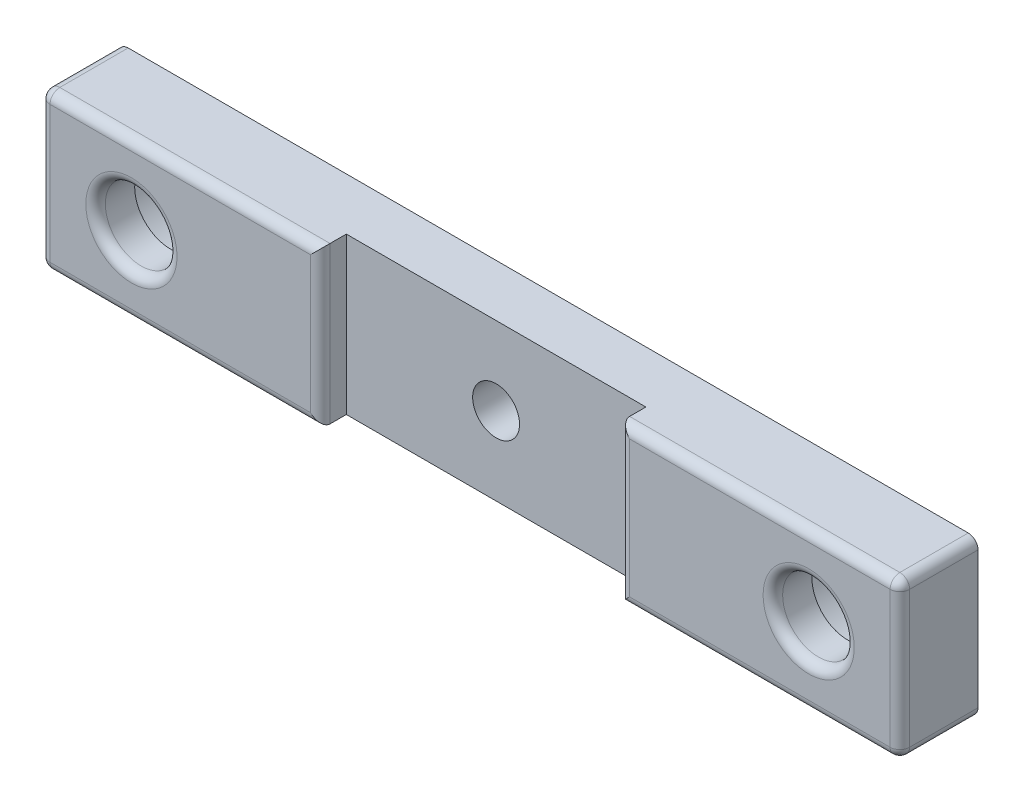
ISO-10303-21;
HEADER;
FILE_DESCRIPTION(('STEP AP214'),'2;1');
FILE_NAME('part.step','',(''),(''),'','','');
FILE_SCHEMA(('AUTOMOTIVE_DESIGN { 1 0 10303 214 1 1 1 1 }'));
ENDSEC;
DATA;
#1=APPLICATION_CONTEXT('core data for automotive mechanical design processes');
#2=APPLICATION_PROTOCOL_DEFINITION('international standard','automotive_design',2000,#1);
#3=PRODUCT_CONTEXT('',#1,'mechanical');
#4=PRODUCT('Part','Part','',(#3));
#5=PRODUCT_RELATED_PRODUCT_CATEGORY('part','',(#4));
#6=PRODUCT_DEFINITION_FORMATION('','',#4);
#7=PRODUCT_DEFINITION_CONTEXT('part definition',#1,'design');
#8=PRODUCT_DEFINITION('design','',#6,#7);
#9=PRODUCT_DEFINITION_SHAPE('','',#8);
#10=(LENGTH_UNIT() NAMED_UNIT(*) SI_UNIT(.MILLI.,.METRE.));
#11=(NAMED_UNIT(*) PLANE_ANGLE_UNIT() SI_UNIT($,.RADIAN.));
#12=(NAMED_UNIT(*) SI_UNIT($,.STERADIAN.) SOLID_ANGLE_UNIT());
#13=UNCERTAINTY_MEASURE_WITH_UNIT(LENGTH_MEASURE(1.E-05),#10,'distance_accuracy_value','');
#14=(GEOMETRIC_REPRESENTATION_CONTEXT(3) GLOBAL_UNCERTAINTY_ASSIGNED_CONTEXT((#13)) GLOBAL_UNIT_ASSIGNED_CONTEXT((#10,
#11,#12)) REPRESENTATION_CONTEXT('',''));
#15=CARTESIAN_POINT('',(0.,0.,0.));
#16=DIRECTION('',(0.,0.,1.));
#17=DIRECTION('',(1.,0.,0.));
#18=AXIS2_PLACEMENT_3D('',#15,#16,#17);
#19=CARTESIAN_POINT('',(7.,6.,6.));
#20=DIRECTION('',(0.,0.,-1.));
#21=DIRECTION('',(-1.,0.,0.));
#22=AXIS2_PLACEMENT_3D('',#19,#20,#21);
#23=CYLINDRICAL_SURFACE('',#22,2.75);
#24=CARTESIAN_POINT('',(7.,6.,5.25));
#25=DIRECTION('',(0.,0.,-1.));
#26=DIRECTION('',(-1.,0.,0.));
#27=AXIS2_PLACEMENT_3D('',#24,#25,#26);
#28=CIRCLE('',#27,2.75);
#29=CARTESIAN_POINT('',(4.25,6.,5.25));
#30=VERTEX_POINT('',#29);
#31=EDGE_CURVE('E264',#30,#30,#28,.F.);
#32=ORIENTED_EDGE('',*,*,#31,.T.);
#33=EDGE_LOOP('',(#32));
#34=FACE_BOUND('',#33,.T.);
#35=CARTESIAN_POINT('',(7.,6.,3.));
#36=DIRECTION('',(0.,0.,-1.));
#37=DIRECTION('',(-1.,0.,0.));
#38=AXIS2_PLACEMENT_3D('',#35,#36,#37);
#39=CIRCLE('',#38,2.75);
#40=CARTESIAN_POINT('',(4.25,6.,3.));
#41=VERTEX_POINT('',#40);
#42=EDGE_CURVE('E202',#41,#41,#39,.F.);
#43=ORIENTED_EDGE('',*,*,#42,.F.);
#44=EDGE_LOOP('',(#43));
#45=FACE_BOUND('',#44,.T.);
#46=ADVANCED_FACE('F32',(#34,#45),#23,.F.);
#47=CARTESIAN_POINT('',(59.,6.,6.));
#48=DIRECTION('',(0.,0.,-1.));
#49=DIRECTION('',(-1.,0.,0.));
#50=AXIS2_PLACEMENT_3D('',#47,#48,#49);
#51=CYLINDRICAL_SURFACE('',#50,2.75);
#52=CARTESIAN_POINT('',(59.,6.,5.25));
#53=DIRECTION('',(0.,0.,-1.));
#54=DIRECTION('',(-1.,0.,0.));
#55=AXIS2_PLACEMENT_3D('',#52,#53,#54);
#56=CIRCLE('',#55,2.75);
#57=CARTESIAN_POINT('',(56.25,6.,5.25));
#58=VERTEX_POINT('',#57);
#59=EDGE_CURVE('E243',#58,#58,#56,.F.);
#60=ORIENTED_EDGE('',*,*,#59,.T.);
#61=EDGE_LOOP('',(#60));
#62=FACE_BOUND('',#61,.T.);
#63=CARTESIAN_POINT('',(59.,6.,3.));
#64=DIRECTION('',(0.,0.,-1.));
#65=DIRECTION('',(-1.,0.,0.));
#66=AXIS2_PLACEMENT_3D('',#63,#64,#65);
#67=CIRCLE('',#66,2.75);
#68=CARTESIAN_POINT('',(56.25,6.,3.));
#69=VERTEX_POINT('',#68);
#70=EDGE_CURVE('E199',#69,#69,#67,.F.);
#71=ORIENTED_EDGE('',*,*,#70,.F.);
#72=EDGE_LOOP('',(#71));
#73=FACE_BOUND('',#72,.T.);
#74=ADVANCED_FACE('F395',(#62,#73),#51,.F.);
#75=CARTESIAN_POINT('',(0.,0.,6.));
#76=DIRECTION('',(0.,0.,-1.));
#77=DIRECTION('',(-1.,0.,0.));
#78=AXIS2_PLACEMENT_3D('',#75,#76,#77);
#79=PLANE('',#78);
#80=DIRECTION('',(-1.,0.,0.));
#81=VECTOR('',#80,1.);
#82=CARTESIAN_POINT('',(0.,11.25,6.));
#83=LINE('',#82,#81);
#84=CARTESIAN_POINT('',(20.75,11.25,6.));
#85=VERTEX_POINT('',#84);
#86=CARTESIAN_POINT('',(0.75,11.25,6.));
#87=VERTEX_POINT('',#86);
#88=EDGE_CURVE('E253',#85,#87,#83,.T.);
#89=ORIENTED_EDGE('',*,*,#88,.T.);
#90=DIRECTION('',(0.,-1.,0.));
#91=VECTOR('',#90,1.);
#92=CARTESIAN_POINT('',(0.75,0.,6.));
#93=LINE('',#92,#91);
#94=CARTESIAN_POINT('',(0.75,0.75,6.));
#95=VERTEX_POINT('',#94);
#96=EDGE_CURVE('E255',#87,#95,#93,.T.);
#97=ORIENTED_EDGE('',*,*,#96,.T.);
#98=DIRECTION('',(1.,0.,0.));
#99=VECTOR('',#98,1.);
#100=CARTESIAN_POINT('',(0.,0.75,6.));
#101=LINE('',#100,#99);
#102=CARTESIAN_POINT('',(20.75,0.75,6.));
#103=VERTEX_POINT('',#102);
#104=EDGE_CURVE('E249',#95,#103,#101,.T.);
#105=ORIENTED_EDGE('',*,*,#104,.T.);
#106=DIRECTION('',(0.,-1.,0.));
#107=VECTOR('',#106,1.);
#108=CARTESIAN_POINT('',(20.75,0.,6.));
#109=LINE('',#108,#107);
#110=EDGE_CURVE('E251',#103,#85,#109,.F.);
#111=ORIENTED_EDGE('',*,*,#110,.T.);
#112=EDGE_LOOP('',(#89,#97,#105,#111));
#113=FACE_BOUND('',#112,.T.);
#114=CARTESIAN_POINT('',(7.,6.,6.));
#115=DIRECTION('',(0.,0.,-1.));
#116=DIRECTION('',(-1.,0.,0.));
#117=AXIS2_PLACEMENT_3D('',#114,#115,#116);
#118=CIRCLE('',#117,3.5);
#119=CARTESIAN_POINT('',(3.5,6.,6.));
#120=VERTEX_POINT('',#119);
#121=EDGE_CURVE('E246',#120,#120,#118,.T.);
#122=ORIENTED_EDGE('',*,*,#121,.T.);
#123=EDGE_LOOP('',(#122));
#124=FACE_BOUND('',#123,.T.);
#125=ADVANCED_FACE('F401',(#113,#124),#79,.F.);
#126=CARTESIAN_POINT('',(0.,0.,6.));
#127=DIRECTION('',(1.,0.,0.));
#128=DIRECTION('',(0.,0.,-1.));
#129=AXIS2_PLACEMENT_3D('',#126,#127,#128);
#130=PLANE('',#129);
#131=DIRECTION('',(0.,-1.,0.));
#132=VECTOR('',#131,1.);
#133=CARTESIAN_POINT('',(0.,0.,5.25));
#134=LINE('',#133,#132);
#135=CARTESIAN_POINT('',(0.,0.75,5.25));
#136=VERTEX_POINT('',#135);
#137=CARTESIAN_POINT('',(0.,11.25,5.25));
#138=VERTEX_POINT('',#137);
#139=EDGE_CURVE('E259',#136,#138,#134,.F.);
#140=ORIENTED_EDGE('',*,*,#139,.T.);
#141=DIRECTION('',(0.,0.,-1.));
#142=VECTOR('',#141,1.);
#143=CARTESIAN_POINT('',(0.,11.25,6.));
#144=LINE('',#143,#142);
#145=CARTESIAN_POINT('',(0.,11.25,0.));
#146=VERTEX_POINT('',#145);
#147=EDGE_CURVE('E261',#138,#146,#144,.T.);
#148=ORIENTED_EDGE('',*,*,#147,.T.);
#149=DIRECTION('',(0.,-1.,0.));
#150=VECTOR('',#149,1.);
#151=CARTESIAN_POINT('',(0.,0.,0.));
#152=LINE('',#151,#150);
#153=CARTESIAN_POINT('',(0.,0.75,0.));
#154=VERTEX_POINT('',#153);
#155=EDGE_CURVE('E183',#146,#154,#152,.T.);
#156=ORIENTED_EDGE('',*,*,#155,.T.);
#157=DIRECTION('',(0.,0.,-1.));
#158=VECTOR('',#157,1.);
#159=CARTESIAN_POINT('',(0.,0.75,6.));
#160=LINE('',#159,#158);
#161=EDGE_CURVE('E57',#154,#136,#160,.F.);
#162=ORIENTED_EDGE('',*,*,#161,.T.);
#163=EDGE_LOOP('',(#140,#148,#156,#162));
#164=FACE_BOUND('',#163,.T.);
#165=ADVANCED_FACE('F335',(#164),#130,.F.);
#166=CARTESIAN_POINT('',(0.,0.,6.));
#167=DIRECTION('',(0.,1.,0.));
#168=DIRECTION('',(0.,0.,1.));
#169=AXIS2_PLACEMENT_3D('',#166,#167,#168);
#170=PLANE('',#169);
#171=DIRECTION('',(0.,0.,1.));
#172=VECTOR('',#171,1.);
#173=CARTESIAN_POINT('',(21.5,0.,4.));
#174=LINE('',#173,#172);
#175=CARTESIAN_POINT('',(21.5,0.,4.));
#176=VERTEX_POINT('',#175);
#177=CARTESIAN_POINT('',(21.5,0.,5.25));
#178=VERTEX_POINT('',#177);
#179=EDGE_CURVE('E149',#176,#178,#174,.T.);
#180=ORIENTED_EDGE('',*,*,#179,.T.);
#181=DIRECTION('',(1.,0.,0.));
#182=VECTOR('',#181,1.);
#183=CARTESIAN_POINT('',(0.,0.,5.25));
#184=LINE('',#183,#182);
#185=CARTESIAN_POINT('',(0.75,0.,5.25));
#186=VERTEX_POINT('',#185);
#187=EDGE_CURVE('E231',#178,#186,#184,.F.);
#188=ORIENTED_EDGE('',*,*,#187,.T.);
#189=DIRECTION('',(0.,0.,-1.));
#190=VECTOR('',#189,1.);
#191=CARTESIAN_POINT('',(0.75,0.,6.));
#192=LINE('',#191,#190);
#193=CARTESIAN_POINT('',(0.75,0.,0.));
#194=VERTEX_POINT('',#193);
#195=EDGE_CURVE('E229',#186,#194,#192,.T.);
#196=ORIENTED_EDGE('',*,*,#195,.T.);
#197=DIRECTION('',(1.,0.,0.));
#198=VECTOR('',#197,1.);
#199=CARTESIAN_POINT('',(0.,0.,0.));
#200=LINE('',#199,#198);
#201=CARTESIAN_POINT('',(65.25,0.,0.));
#202=VERTEX_POINT('',#201);
#203=EDGE_CURVE('E189',#194,#202,#200,.T.);
#204=ORIENTED_EDGE('',*,*,#203,.T.);
#205=DIRECTION('',(0.,0.,-1.));
#206=VECTOR('',#205,1.);
#207=CARTESIAN_POINT('',(65.25,0.,6.));
#208=LINE('',#207,#206);
#209=CARTESIAN_POINT('',(65.25,0.,5.25));
#210=VERTEX_POINT('',#209);
#211=EDGE_CURVE('E225',#202,#210,#208,.F.);
#212=ORIENTED_EDGE('',*,*,#211,.T.);
#213=DIRECTION('',(1.,0.,0.));
#214=VECTOR('',#213,1.);
#215=CARTESIAN_POINT('',(0.,0.,5.25));
#216=LINE('',#215,#214);
#217=CARTESIAN_POINT('',(44.5,0.,5.25));
#218=VERTEX_POINT('',#217);
#219=EDGE_CURVE('E227',#210,#218,#216,.F.);
#220=ORIENTED_EDGE('',*,*,#219,.T.);
#221=DIRECTION('',(0.,0.,1.));
#222=VECTOR('',#221,1.);
#223=CARTESIAN_POINT('',(44.5,0.,4.));
#224=LINE('',#223,#222);
#225=CARTESIAN_POINT('',(44.5,0.,4.));
#226=VERTEX_POINT('',#225);
#227=EDGE_CURVE('E160',#226,#218,#224,.T.);
#228=ORIENTED_EDGE('',*,*,#227,.F.);
#229=DIRECTION('',(1.,0.,0.));
#230=VECTOR('',#229,1.);
#231=CARTESIAN_POINT('',(21.5,0.,4.));
#232=LINE('',#231,#230);
#233=EDGE_CURVE('E167',#176,#226,#232,.T.);
#234=ORIENTED_EDGE('',*,*,#233,.F.);
#235=EDGE_LOOP('',(#180,#188,#196,#204,#212,#220,#228,#234));
#236=FACE_BOUND('',#235,.T.);
#237=ADVANCED_FACE('F173',(#236),#170,.F.);
#238=CARTESIAN_POINT('',(66.,0.,6.));
#239=DIRECTION('',(-1.,0.,0.));
#240=DIRECTION('',(0.,0.,1.));
#241=AXIS2_PLACEMENT_3D('',#238,#239,#240);
#242=PLANE('',#241);
#243=DIRECTION('',(0.,1.,0.));
#244=VECTOR('',#243,1.);
#245=CARTESIAN_POINT('',(66.,0.,5.25));
#246=LINE('',#245,#244);
#247=CARTESIAN_POINT('',(66.,11.25,5.25));
#248=VERTEX_POINT('',#247);
#249=CARTESIAN_POINT('',(66.,0.75,5.25));
#250=VERTEX_POINT('',#249);
#251=EDGE_CURVE('E220',#248,#250,#246,.F.);
#252=ORIENTED_EDGE('',*,*,#251,.T.);
#253=DIRECTION('',(0.,0.,-1.));
#254=VECTOR('',#253,1.);
#255=CARTESIAN_POINT('',(66.,0.75,6.));
#256=LINE('',#255,#254);
#257=CARTESIAN_POINT('',(66.,0.75,0.));
#258=VERTEX_POINT('',#257);
#259=EDGE_CURVE('E223',#250,#258,#256,.T.);
#260=ORIENTED_EDGE('',*,*,#259,.T.);
#261=DIRECTION('',(0.,1.,0.));
#262=VECTOR('',#261,1.);
#263=CARTESIAN_POINT('',(66.,0.,0.));
#264=LINE('',#263,#262);
#265=CARTESIAN_POINT('',(66.,11.25,0.));
#266=VERTEX_POINT('',#265);
#267=EDGE_CURVE('E192',#258,#266,#264,.T.);
#268=ORIENTED_EDGE('',*,*,#267,.T.);
#269=DIRECTION('',(0.,0.,-1.));
#270=VECTOR('',#269,1.);
#271=CARTESIAN_POINT('',(66.,11.25,6.));
#272=LINE('',#271,#270);
#273=EDGE_CURVE('E218',#266,#248,#272,.F.);
#274=ORIENTED_EDGE('',*,*,#273,.T.);
#275=EDGE_LOOP('',(#252,#260,#268,#274));
#276=FACE_BOUND('',#275,.T.);
#277=ADVANCED_FACE('F363',(#276),#242,.F.);
#278=CARTESIAN_POINT('',(0.,12.,6.));
#279=DIRECTION('',(0.,-1.,0.));
#280=DIRECTION('',(0.,0.,-1.));
#281=AXIS2_PLACEMENT_3D('',#278,#279,#280);
#282=PLANE('',#281);
#283=DIRECTION('',(0.,0.,-1.));
#284=VECTOR('',#283,1.);
#285=CARTESIAN_POINT('',(0.75,12.,6.));
#286=LINE('',#285,#284);
#287=CARTESIAN_POINT('',(0.75,12.,0.));
#288=VERTEX_POINT('',#287);
#289=CARTESIAN_POINT('',(0.75,12.,5.25));
#290=VERTEX_POINT('',#289);
#291=EDGE_CURVE('E239',#288,#290,#286,.F.);
#292=ORIENTED_EDGE('',*,*,#291,.T.);
#293=DIRECTION('',(-1.,0.,0.));
#294=VECTOR('',#293,1.);
#295=CARTESIAN_POINT('',(0.,12.,5.25));
#296=LINE('',#295,#294);
#297=CARTESIAN_POINT('',(21.5,12.,5.25));
#298=VERTEX_POINT('',#297);
#299=EDGE_CURVE('E241',#290,#298,#296,.F.);
#300=ORIENTED_EDGE('',*,*,#299,.T.);
#301=DIRECTION('',(0.,0.,1.));
#302=VECTOR('',#301,1.);
#303=CARTESIAN_POINT('',(21.5,12.,4.));
#304=LINE('',#303,#302);
#305=CARTESIAN_POINT('',(21.5,12.,4.));
#306=VERTEX_POINT('',#305);
#307=EDGE_CURVE('E181',#306,#298,#304,.T.);
#308=ORIENTED_EDGE('',*,*,#307,.F.);
#309=DIRECTION('',(-1.,0.,0.));
#310=VECTOR('',#309,1.);
#311=CARTESIAN_POINT('',(21.5,12.,4.));
#312=LINE('',#311,#310);
#313=CARTESIAN_POINT('',(44.5,12.,4.));
#314=VERTEX_POINT('',#313);
#315=EDGE_CURVE('E161',#314,#306,#312,.T.);
#316=ORIENTED_EDGE('',*,*,#315,.F.);
#317=DIRECTION('',(0.,0.,1.));
#318=VECTOR('',#317,1.);
#319=CARTESIAN_POINT('',(44.5,12.,4.));
#320=LINE('',#319,#318);
#321=CARTESIAN_POINT('',(44.5,12.,5.25));
#322=VERTEX_POINT('',#321);
#323=EDGE_CURVE('E184',#314,#322,#320,.T.);
#324=ORIENTED_EDGE('',*,*,#323,.T.);
#325=DIRECTION('',(-1.,0.,0.));
#326=VECTOR('',#325,1.);
#327=CARTESIAN_POINT('',(0.,12.,5.25));
#328=LINE('',#327,#326);
#329=CARTESIAN_POINT('',(65.25,12.,5.25));
#330=VERTEX_POINT('',#329);
#331=EDGE_CURVE('E237',#322,#330,#328,.F.);
#332=ORIENTED_EDGE('',*,*,#331,.T.);
#333=DIRECTION('',(0.,0.,-1.));
#334=VECTOR('',#333,1.);
#335=CARTESIAN_POINT('',(65.25,12.,6.));
#336=LINE('',#335,#334);
#337=CARTESIAN_POINT('',(65.25,12.,0.));
#338=VERTEX_POINT('',#337);
#339=EDGE_CURVE('E235',#330,#338,#336,.T.);
#340=ORIENTED_EDGE('',*,*,#339,.T.);
#341=DIRECTION('',(-1.,0.,0.));
#342=VECTOR('',#341,1.);
#343=CARTESIAN_POINT('',(0.,12.,0.));
#344=LINE('',#343,#342);
#345=EDGE_CURVE('E195',#338,#288,#344,.T.);
#346=ORIENTED_EDGE('',*,*,#345,.T.);
#347=EDGE_LOOP('',(#292,#300,#308,#316,#324,#332,#340,#346));
#348=FACE_BOUND('',#347,.T.);
#349=ADVANCED_FACE('F343',(#348),#282,.F.);
#350=DIRECTION('',(1.,0.,0.));
#351=VECTOR('',#350,1.);
#352=CARTESIAN_POINT('',(0.,0.75,6.));
#353=LINE('',#352,#351);
#354=CARTESIAN_POINT('',(45.25,0.75,6.));
#355=VERTEX_POINT('',#354);
#356=CARTESIAN_POINT('',(65.25,0.75,6.));
#357=VERTEX_POINT('',#356);
#358=EDGE_CURVE('E213',#355,#357,#353,.T.);
#359=ORIENTED_EDGE('',*,*,#358,.T.);
#360=DIRECTION('',(0.,1.,0.));
#361=VECTOR('',#360,1.);
#362=CARTESIAN_POINT('',(65.25,0.,6.));
#363=LINE('',#362,#361);
#364=CARTESIAN_POINT('',(65.25,11.25,6.));
#365=VERTEX_POINT('',#364);
#366=EDGE_CURVE('E215',#357,#365,#363,.T.);
#367=ORIENTED_EDGE('',*,*,#366,.T.);
#368=DIRECTION('',(-1.,0.,0.));
#369=VECTOR('',#368,1.);
#370=CARTESIAN_POINT('',(0.,11.25,6.));
#371=LINE('',#370,#369);
#372=CARTESIAN_POINT('',(45.25,11.25,6.));
#373=VERTEX_POINT('',#372);
#374=EDGE_CURVE('E209',#365,#373,#371,.T.);
#375=ORIENTED_EDGE('',*,*,#374,.T.);
#376=DIRECTION('',(0.,1.,0.));
#377=VECTOR('',#376,1.);
#378=CARTESIAN_POINT('',(45.25,0.,6.));
#379=LINE('',#378,#377);
#380=EDGE_CURVE('E211',#373,#355,#379,.F.);
#381=ORIENTED_EDGE('',*,*,#380,.T.);
#382=EDGE_LOOP('',(#359,#367,#375,#381));
#383=FACE_BOUND('',#382,.T.);
#384=CARTESIAN_POINT('',(59.,6.,6.));
#385=DIRECTION('',(0.,0.,-1.));
#386=DIRECTION('',(-1.,0.,0.));
#387=AXIS2_PLACEMENT_3D('',#384,#385,#386);
#388=CIRCLE('',#387,3.5);
#389=CARTESIAN_POINT('',(55.5,6.,6.));
#390=VERTEX_POINT('',#389);
#391=EDGE_CURVE('E198',#390,#390,#388,.T.);
#392=ORIENTED_EDGE('',*,*,#391,.T.);
#393=EDGE_LOOP('',(#392));
#394=FACE_BOUND('',#393,.T.);
#395=ADVANCED_FACE('F443',(#383,#394),#79,.F.);
#396=CARTESIAN_POINT('',(0.,0.,0.));
#397=DIRECTION('',(0.,0.,-1.));
#398=DIRECTION('',(-1.,0.,0.));
#399=AXIS2_PLACEMENT_3D('',#396,#397,#398);
#400=PLANE('',#399);
#401=CARTESIAN_POINT('',(59.,6.,0.));
#402=DIRECTION('',(0.,0.,-1.));
#403=DIRECTION('',(-1.,0.,0.));
#404=AXIS2_PLACEMENT_3D('',#401,#402,#403);
#405=CIRCLE('',#404,5.1);
#406=CARTESIAN_POINT('',(53.9,6.,0.));
#407=VERTEX_POINT('',#406);
#408=EDGE_CURVE('E428',#407,#407,#405,.T.);
#409=ORIENTED_EDGE('',*,*,#408,.F.);
#410=EDGE_LOOP('',(#409));
#411=FACE_BOUND('',#410,.T.);
#412=CARTESIAN_POINT('',(7.,6.,0.));
#413=DIRECTION('',(0.,0.,-1.));
#414=DIRECTION('',(-1.,0.,0.));
#415=AXIS2_PLACEMENT_3D('',#412,#413,#414);
#416=CIRCLE('',#415,5.1);
#417=CARTESIAN_POINT('',(1.9,6.,0.));
#418=VERTEX_POINT('',#417);
#419=EDGE_CURVE('E294',#418,#418,#416,.T.);
#420=ORIENTED_EDGE('',*,*,#419,.F.);
#421=EDGE_LOOP('',(#420));
#422=FACE_BOUND('',#421,.T.);
#423=CARTESIAN_POINT('',(33.,6.,0.));
#424=DIRECTION('',(0.,0.,1.));
#425=DIRECTION('',(1.,0.,0.));
#426=AXIS2_PLACEMENT_3D('',#423,#424,#425);
#427=CIRCLE('',#426,1.8);
#428=CARTESIAN_POINT('',(34.8,6.,0.));
#429=VERTEX_POINT('',#428);
#430=EDGE_CURVE('E171',#429,#429,#427,.T.);
#431=ORIENTED_EDGE('',*,*,#430,.T.);
#432=EDGE_LOOP('',(#431));
#433=FACE_BOUND('',#432,.T.);
#434=ORIENTED_EDGE('',*,*,#155,.F.);
#435=CARTESIAN_POINT('',(0.75,11.25,0.));
#436=DIRECTION('',(0.,0.,-1.));
#437=DIRECTION('',(-1.,0.,0.));
#438=AXIS2_PLACEMENT_3D('',#435,#436,#437);
#439=CIRCLE('',#438,0.75);
#440=EDGE_CURVE('E11',#146,#288,#439,.T.);
#441=ORIENTED_EDGE('',*,*,#440,.T.);
#442=ORIENTED_EDGE('',*,*,#345,.F.);
#443=CARTESIAN_POINT('',(65.25,11.25,0.));
#444=DIRECTION('',(0.,0.,-1.));
#445=DIRECTION('',(-1.,0.,0.));
#446=AXIS2_PLACEMENT_3D('',#443,#444,#445);
#447=CIRCLE('',#446,0.75);
#448=EDGE_CURVE('E267',#338,#266,#447,.T.);
#449=ORIENTED_EDGE('',*,*,#448,.T.);
#450=ORIENTED_EDGE('',*,*,#267,.F.);
#451=CARTESIAN_POINT('',(65.25,0.75,0.));
#452=DIRECTION('',(0.,0.,-1.));
#453=DIRECTION('',(-1.,0.,0.));
#454=AXIS2_PLACEMENT_3D('',#451,#452,#453);
#455=CIRCLE('',#454,0.75);
#456=EDGE_CURVE('E269',#258,#202,#455,.T.);
#457=ORIENTED_EDGE('',*,*,#456,.T.);
#458=ORIENTED_EDGE('',*,*,#203,.F.);
#459=CARTESIAN_POINT('',(0.75,0.75,0.));
#460=DIRECTION('',(0.,0.,-1.));
#461=DIRECTION('',(-1.,0.,0.));
#462=AXIS2_PLACEMENT_3D('',#459,#460,#461);
#463=CIRCLE('',#462,0.75);
#464=EDGE_CURVE('E41',#194,#154,#463,.T.);
#465=ORIENTED_EDGE('',*,*,#464,.T.);
#466=EDGE_LOOP('',(#434,#441,#442,#449,#450,#457,#458,#465));
#467=FACE_BOUND('',#466,.T.);
#468=ADVANCED_FACE('F333',(#411,#422,#433,#467),#400,.T.);
#469=CARTESIAN_POINT('',(21.5,0.,4.));
#470=DIRECTION('',(-1.,0.,0.));
#471=DIRECTION('',(0.,0.,1.));
#472=AXIS2_PLACEMENT_3D('',#469,#470,#471);
#473=PLANE('',#472);
#474=ORIENTED_EDGE('',*,*,#307,.T.);
#475=DIRECTION('',(0.,-1.,0.));
#476=VECTOR('',#475,1.);
#477=CARTESIAN_POINT('',(21.5,0.,5.25));
#478=LINE('',#477,#476);
#479=EDGE_CURVE('E156',#298,#178,#478,.T.);
#480=ORIENTED_EDGE('',*,*,#479,.T.);
#481=ORIENTED_EDGE('',*,*,#179,.F.);
#482=DIRECTION('',(0.,-1.,0.));
#483=VECTOR('',#482,1.);
#484=CARTESIAN_POINT('',(21.5,0.,4.));
#485=LINE('',#484,#483);
#486=EDGE_CURVE('E153',#306,#176,#485,.T.);
#487=ORIENTED_EDGE('',*,*,#486,.F.);
#488=EDGE_LOOP('',(#474,#480,#481,#487));
#489=FACE_BOUND('',#488,.T.);
#490=ADVANCED_FACE('F152',(#489),#473,.F.);
#491=CARTESIAN_POINT('',(44.5,0.,4.));
#492=DIRECTION('',(1.,0.,0.));
#493=DIRECTION('',(0.,0.,-1.));
#494=AXIS2_PLACEMENT_3D('',#491,#492,#493);
#495=PLANE('',#494);
#496=ORIENTED_EDGE('',*,*,#227,.T.);
#497=DIRECTION('',(0.,1.,0.));
#498=VECTOR('',#497,1.);
#499=CARTESIAN_POINT('',(44.5,0.,5.25));
#500=LINE('',#499,#498);
#501=EDGE_CURVE('E233',#218,#322,#500,.T.);
#502=ORIENTED_EDGE('',*,*,#501,.T.);
#503=ORIENTED_EDGE('',*,*,#323,.F.);
#504=DIRECTION('',(0.,1.,0.));
#505=VECTOR('',#504,1.);
#506=CARTESIAN_POINT('',(44.5,0.,4.));
#507=LINE('',#506,#505);
#508=EDGE_CURVE('E175',#226,#314,#507,.T.);
#509=ORIENTED_EDGE('',*,*,#508,.F.);
#510=EDGE_LOOP('',(#496,#502,#503,#509));
#511=FACE_BOUND('',#510,.T.);
#512=ADVANCED_FACE('F383',(#511),#495,.F.);
#513=CARTESIAN_POINT('',(0.,0.,4.));
#514=DIRECTION('',(0.,0.,-1.));
#515=DIRECTION('',(-1.,0.,0.));
#516=AXIS2_PLACEMENT_3D('',#513,#514,#515);
#517=PLANE('',#516);
#518=CARTESIAN_POINT('',(33.,6.,4.));
#519=DIRECTION('',(0.,0.,1.));
#520=DIRECTION('',(1.,0.,0.));
#521=AXIS2_PLACEMENT_3D('',#518,#519,#520);
#522=CIRCLE('',#521,1.8);
#523=CARTESIAN_POINT('',(34.8,6.,4.));
#524=VERTEX_POINT('',#523);
#525=EDGE_CURVE('E206',#524,#524,#522,.T.);
#526=ORIENTED_EDGE('',*,*,#525,.F.);
#527=EDGE_LOOP('',(#526));
#528=FACE_BOUND('',#527,.T.);
#529=ORIENTED_EDGE('',*,*,#486,.T.);
#530=ORIENTED_EDGE('',*,*,#233,.T.);
#531=ORIENTED_EDGE('',*,*,#508,.T.);
#532=ORIENTED_EDGE('',*,*,#315,.T.);
#533=EDGE_LOOP('',(#529,#530,#531,#532));
#534=FACE_BOUND('',#533,.T.);
#535=ADVANCED_FACE('F165',(#528,#534),#517,.F.);
#536=CARTESIAN_POINT('',(33.,6.,0.));
#537=DIRECTION('',(0.,0.,1.));
#538=DIRECTION('',(1.,0.,0.));
#539=AXIS2_PLACEMENT_3D('',#536,#537,#538);
#540=CYLINDRICAL_SURFACE('',#539,1.8);
#541=ORIENTED_EDGE('',*,*,#430,.F.);
#542=EDGE_LOOP('',(#541));
#543=FACE_BOUND('',#542,.T.);
#544=ORIENTED_EDGE('',*,*,#525,.T.);
#545=EDGE_LOOP('',(#544));
#546=FACE_BOUND('',#545,.T.);
#547=ADVANCED_FACE('F390',(#543,#546),#540,.F.);
#548=CARTESIAN_POINT('',(59.,6.,3.));
#549=DIRECTION('',(0.,0.,-1.));
#550=DIRECTION('',(-1.,0.,0.));
#551=AXIS2_PLACEMENT_3D('',#548,#549,#550);
#552=PLANE('',#551);
#553=CARTESIAN_POINT('',(59.,6.,3.));
#554=DIRECTION('',(0.,0.,-1.));
#555=DIRECTION('',(-1.,0.,0.));
#556=AXIS2_PLACEMENT_3D('',#553,#554,#555);
#557=CIRCLE('',#556,5.1);
#558=CARTESIAN_POINT('',(53.9,6.,3.));
#559=VERTEX_POINT('',#558);
#560=EDGE_CURVE('E203',#559,#559,#557,.T.);
#561=ORIENTED_EDGE('',*,*,#560,.T.);
#562=EDGE_LOOP('',(#561));
#563=FACE_BOUND('',#562,.T.);
#564=ORIENTED_EDGE('',*,*,#70,.T.);
#565=EDGE_LOOP('',(#564));
#566=FACE_BOUND('',#565,.T.);
#567=ADVANCED_FACE('F408',(#563,#566),#552,.T.);
#568=CARTESIAN_POINT('',(59.,6.,3.));
#569=DIRECTION('',(0.,0.,-1.));
#570=DIRECTION('',(-1.,0.,0.));
#571=AXIS2_PLACEMENT_3D('',#568,#569,#570);
#572=CYLINDRICAL_SURFACE('',#571,5.1);
#573=ORIENTED_EDGE('',*,*,#560,.F.);
#574=EDGE_LOOP('',(#573));
#575=FACE_BOUND('',#574,.T.);
#576=ORIENTED_EDGE('',*,*,#408,.T.);
#577=EDGE_LOOP('',(#576));
#578=FACE_BOUND('',#577,.T.);
#579=ADVANCED_FACE('F413',(#575,#578),#572,.F.);
#580=CARTESIAN_POINT('',(7.,6.,3.));
#581=DIRECTION('',(0.,0.,-1.));
#582=DIRECTION('',(-1.,0.,0.));
#583=AXIS2_PLACEMENT_3D('',#580,#581,#582);
#584=PLANE('',#583);
#585=CARTESIAN_POINT('',(7.,6.,3.));
#586=DIRECTION('',(0.,0.,-1.));
#587=DIRECTION('',(-1.,0.,0.));
#588=AXIS2_PLACEMENT_3D('',#585,#586,#587);
#589=CIRCLE('',#588,5.1);
#590=CARTESIAN_POINT('',(1.9,6.,3.));
#591=VERTEX_POINT('',#590);
#592=EDGE_CURVE('E425',#591,#591,#589,.T.);
#593=ORIENTED_EDGE('',*,*,#592,.T.);
#594=EDGE_LOOP('',(#593));
#595=FACE_BOUND('',#594,.T.);
#596=ORIENTED_EDGE('',*,*,#42,.T.);
#597=EDGE_LOOP('',(#596));
#598=FACE_BOUND('',#597,.T.);
#599=ADVANCED_FACE('F437',(#595,#598),#584,.T.);
#600=CARTESIAN_POINT('',(7.,6.,3.));
#601=DIRECTION('',(0.,0.,-1.));
#602=DIRECTION('',(-1.,0.,0.));
#603=AXIS2_PLACEMENT_3D('',#600,#601,#602);
#604=CYLINDRICAL_SURFACE('',#603,5.1);
#605=ORIENTED_EDGE('',*,*,#592,.F.);
#606=EDGE_LOOP('',(#605));
#607=FACE_BOUND('',#606,.T.);
#608=ORIENTED_EDGE('',*,*,#419,.T.);
#609=EDGE_LOOP('',(#608));
#610=FACE_BOUND('',#609,.T.);
#611=ADVANCED_FACE('F448',(#607,#610),#604,.F.);
#612=CARTESIAN_POINT('',(45.25,0.,5.25));
#613=DIRECTION('',(0.,1.,0.));
#614=DIRECTION('',(0.,0.,1.));
#615=AXIS2_PLACEMENT_3D('',#612,#613,#614);
#616=CYLINDRICAL_SURFACE('',#615,0.75);
#617=CARTESIAN_POINT('',(45.25,11.25,5.25));
#618=DIRECTION('',(-0.707106781186547,-0.707106781186547,0.));
#619=DIRECTION('',(-0.707106781186547,0.707106781186547,0.));
#620=AXIS2_PLACEMENT_3D('',#617,#618,#619);
#621=ELLIPSE('',#620,1.06066017177982,0.75);
#622=EDGE_CURVE('E288',#322,#373,#621,.F.);
#623=ORIENTED_EDGE('',*,*,#622,.F.);
#624=ORIENTED_EDGE('',*,*,#501,.F.);
#625=CARTESIAN_POINT('',(45.25,0.75,5.25));
#626=DIRECTION('',(-0.707106781186547,0.707106781186547,0.));
#627=DIRECTION('',(0.707106781186547,0.707106781186547,0.));
#628=AXIS2_PLACEMENT_3D('',#625,#626,#627);
#629=ELLIPSE('',#628,1.06066017177982,0.75);
#630=EDGE_CURVE('E291',#355,#218,#629,.F.);
#631=ORIENTED_EDGE('',*,*,#630,.F.);
#632=ORIENTED_EDGE('',*,*,#380,.F.);
#633=EDGE_LOOP('',(#623,#624,#631,#632));
#634=FACE_BOUND('',#633,.T.);
#635=ADVANCED_FACE('F381',(#634),#616,.T.);
#636=CARTESIAN_POINT('',(65.25,0.75,6.));
#637=DIRECTION('',(0.,0.,-1.));
#638=DIRECTION('',(-1.,0.,0.));
#639=AXIS2_PLACEMENT_3D('',#636,#637,#638);
#640=CYLINDRICAL_SURFACE('',#639,0.75);
#641=ORIENTED_EDGE('',*,*,#456,.F.);
#642=ORIENTED_EDGE('',*,*,#259,.F.);
#643=CARTESIAN_POINT('',(65.25,0.75,5.25));
#644=DIRECTION('',(0.,0.,1.));
#645=DIRECTION('',(1.,0.,0.));
#646=AXIS2_PLACEMENT_3D('',#643,#644,#645);
#647=CIRCLE('',#646,0.75);
#648=EDGE_CURVE('E285',#210,#250,#647,.T.);
#649=ORIENTED_EDGE('',*,*,#648,.F.);
#650=ORIENTED_EDGE('',*,*,#211,.F.);
#651=EDGE_LOOP('',(#641,#642,#649,#650));
#652=FACE_BOUND('',#651,.T.);
#653=ADVANCED_FACE('F369',(#652),#640,.T.);
#654=CARTESIAN_POINT('',(0.,0.75,5.25));
#655=DIRECTION('',(1.,0.,0.));
#656=DIRECTION('',(0.,0.,-1.));
#657=AXIS2_PLACEMENT_3D('',#654,#655,#656);
#658=CYLINDRICAL_SURFACE('',#657,0.75);
#659=ORIENTED_EDGE('',*,*,#630,.T.);
#660=ORIENTED_EDGE('',*,*,#219,.F.);
#661=CARTESIAN_POINT('',(65.25,0.75,5.25));
#662=DIRECTION('',(1.,0.,0.));
#663=DIRECTION('',(0.,0.,-1.));
#664=AXIS2_PLACEMENT_3D('',#661,#662,#663);
#665=CIRCLE('',#664,0.75);
#666=EDGE_CURVE('E282',#357,#210,#665,.T.);
#667=ORIENTED_EDGE('',*,*,#666,.F.);
#668=ORIENTED_EDGE('',*,*,#358,.F.);
#669=EDGE_LOOP('',(#659,#660,#667,#668));
#670=FACE_BOUND('',#669,.T.);
#671=ADVANCED_FACE('F374',(#670),#658,.T.);
#672=CARTESIAN_POINT('',(0.,11.25,5.25));
#673=DIRECTION('',(-1.,0.,0.));
#674=DIRECTION('',(0.,0.,1.));
#675=AXIS2_PLACEMENT_3D('',#672,#673,#674);
#676=CYLINDRICAL_SURFACE('',#675,0.75);
#677=ORIENTED_EDGE('',*,*,#622,.T.);
#678=ORIENTED_EDGE('',*,*,#374,.F.);
#679=CARTESIAN_POINT('',(65.25,11.25,5.25));
#680=DIRECTION('',(1.,0.,0.));
#681=DIRECTION('',(0.,0.,-1.));
#682=AXIS2_PLACEMENT_3D('',#679,#680,#681);
#683=CIRCLE('',#682,0.75);
#684=EDGE_CURVE('E279',#330,#365,#683,.T.);
#685=ORIENTED_EDGE('',*,*,#684,.F.);
#686=ORIENTED_EDGE('',*,*,#331,.F.);
#687=EDGE_LOOP('',(#677,#678,#685,#686));
#688=FACE_BOUND('',#687,.T.);
#689=ADVANCED_FACE('F354',(#688),#676,.T.);
#690=CARTESIAN_POINT('',(65.25,11.25,6.));
#691=DIRECTION('',(0.,0.,-1.));
#692=DIRECTION('',(-1.,0.,0.));
#693=AXIS2_PLACEMENT_3D('',#690,#691,#692);
#694=CYLINDRICAL_SURFACE('',#693,0.75);
#695=ORIENTED_EDGE('',*,*,#448,.F.);
#696=ORIENTED_EDGE('',*,*,#339,.F.);
#697=CARTESIAN_POINT('',(65.25,11.25,5.25));
#698=DIRECTION('',(0.,0.,1.));
#699=DIRECTION('',(1.,0.,0.));
#700=AXIS2_PLACEMENT_3D('',#697,#698,#699);
#701=CIRCLE('',#700,0.75);
#702=EDGE_CURVE('E276',#248,#330,#701,.T.);
#703=ORIENTED_EDGE('',*,*,#702,.F.);
#704=ORIENTED_EDGE('',*,*,#273,.F.);
#705=EDGE_LOOP('',(#695,#696,#703,#704));
#706=FACE_BOUND('',#705,.T.);
#707=ADVANCED_FACE('F349',(#706),#694,.T.);
#708=CARTESIAN_POINT('',(65.25,0.75,5.25));
#709=DIRECTION('',(0.,0.,1.));
#710=DIRECTION('',(1.,0.,0.));
#711=AXIS2_PLACEMENT_3D('',#708,#709,#710);
#712=SPHERICAL_SURFACE('',#711,0.75);
#713=ORIENTED_EDGE('',*,*,#666,.T.);
#714=ORIENTED_EDGE('',*,*,#648,.T.);
#715=CARTESIAN_POINT('',(65.25,0.75,5.25));
#716=DIRECTION('',(0.,-1.,0.));
#717=DIRECTION('',(0.,0.,-1.));
#718=AXIS2_PLACEMENT_3D('',#715,#716,#717);
#719=CIRCLE('',#718,0.75);
#720=EDGE_CURVE('E274',#357,#250,#719,.F.);
#721=ORIENTED_EDGE('',*,*,#720,.F.);
#722=EDGE_LOOP('',(#713,#714,#721));
#723=FACE_BOUND('',#722,.T.);
#724=ADVANCED_FACE('F598',(#723),#712,.T.);
#725=CARTESIAN_POINT('',(65.25,11.25,5.25));
#726=DIRECTION('',(0.,0.,1.));
#727=DIRECTION('',(1.,0.,0.));
#728=AXIS2_PLACEMENT_3D('',#725,#726,#727);
#729=SPHERICAL_SURFACE('',#728,0.75);
#730=ORIENTED_EDGE('',*,*,#702,.T.);
#731=ORIENTED_EDGE('',*,*,#684,.T.);
#732=CARTESIAN_POINT('',(65.25,11.25,5.25));
#733=DIRECTION('',(0.,1.,0.));
#734=DIRECTION('',(0.,0.,1.));
#735=AXIS2_PLACEMENT_3D('',#732,#733,#734);
#736=CIRCLE('',#735,0.75);
#737=EDGE_CURVE('E272',#248,#365,#736,.F.);
#738=ORIENTED_EDGE('',*,*,#737,.F.);
#739=EDGE_LOOP('',(#730,#731,#738));
#740=FACE_BOUND('',#739,.T.);
#741=ADVANCED_FACE('F357',(#740),#729,.T.);
#742=CARTESIAN_POINT('',(65.25,0.,5.25));
#743=DIRECTION('',(0.,1.,0.));
#744=DIRECTION('',(0.,0.,1.));
#745=AXIS2_PLACEMENT_3D('',#742,#743,#744);
#746=CYLINDRICAL_SURFACE('',#745,0.75);
#747=ORIENTED_EDGE('',*,*,#720,.T.);
#748=ORIENTED_EDGE('',*,*,#251,.F.);
#749=ORIENTED_EDGE('',*,*,#737,.T.);
#750=ORIENTED_EDGE('',*,*,#366,.F.);
#751=EDGE_LOOP('',(#747,#748,#749,#750));
#752=FACE_BOUND('',#751,.T.);
#753=ADVANCED_FACE('F360',(#752),#746,.T.);
#754=CARTESIAN_POINT('',(59.,6.,5.25));
#755=DIRECTION('',(0.,0.,-1.));
#756=DIRECTION('',(-1.,0.,0.));
#757=AXIS2_PLACEMENT_3D('',#754,#755,#756);
#758=TOROIDAL_SURFACE('',#757,3.5,0.75);
#759=ORIENTED_EDGE('',*,*,#59,.F.);
#760=EDGE_LOOP('',(#759));
#761=FACE_BOUND('',#760,.T.);
#762=ORIENTED_EDGE('',*,*,#391,.F.);
#763=EDGE_LOOP('',(#762));
#764=FACE_BOUND('',#763,.T.);
#765=ADVANCED_FACE('F621',(#761,#764),#758,.T.);
#766=CARTESIAN_POINT('',(20.75,0.,5.25));
#767=DIRECTION('',(0.,-1.,0.));
#768=DIRECTION('',(0.,0.,-1.));
#769=AXIS2_PLACEMENT_3D('',#766,#767,#768);
#770=CYLINDRICAL_SURFACE('',#769,0.75);
#771=CARTESIAN_POINT('',(20.75,0.75,5.25));
#772=DIRECTION('',(0.707106781186547,0.707106781186547,0.));
#773=DIRECTION('',(0.707106781186547,-0.707106781186547,0.));
#774=AXIS2_PLACEMENT_3D('',#771,#772,#773);
#775=ELLIPSE('',#774,1.06066017177982,0.75);
#776=EDGE_CURVE('E308',#178,#103,#775,.F.);
#777=ORIENTED_EDGE('',*,*,#776,.F.);
#778=ORIENTED_EDGE('',*,*,#479,.F.);
#779=CARTESIAN_POINT('',(20.75,11.25,5.25));
#780=DIRECTION('',(0.707106781186547,-0.707106781186547,0.));
#781=DIRECTION('',(-0.707106781186547,-0.707106781186547,0.));
#782=AXIS2_PLACEMENT_3D('',#779,#780,#781);
#783=ELLIPSE('',#782,1.06066017177982,0.75);
#784=EDGE_CURVE('E36',#85,#298,#783,.F.);
#785=ORIENTED_EDGE('',*,*,#784,.F.);
#786=ORIENTED_EDGE('',*,*,#110,.F.);
#787=EDGE_LOOP('',(#777,#778,#785,#786));
#788=FACE_BOUND('',#787,.T.);
#789=ADVANCED_FACE('F323',(#788),#770,.T.);
#790=CARTESIAN_POINT('',(0.75,11.25,6.));
#791=DIRECTION('',(0.,0.,-1.));
#792=DIRECTION('',(-1.,0.,0.));
#793=AXIS2_PLACEMENT_3D('',#790,#791,#792);
#794=CYLINDRICAL_SURFACE('',#793,0.75);
#795=ORIENTED_EDGE('',*,*,#440,.F.);
#796=ORIENTED_EDGE('',*,*,#147,.F.);
#797=CARTESIAN_POINT('',(0.75,11.25,5.25));
#798=DIRECTION('',(0.,0.,1.));
#799=DIRECTION('',(1.,0.,0.));
#800=AXIS2_PLACEMENT_3D('',#797,#798,#799);
#801=CIRCLE('',#800,0.75);
#802=EDGE_CURVE('E307',#290,#138,#801,.T.);
#803=ORIENTED_EDGE('',*,*,#802,.F.);
#804=ORIENTED_EDGE('',*,*,#291,.F.);
#805=EDGE_LOOP('',(#795,#796,#803,#804));
#806=FACE_BOUND('',#805,.T.);
#807=ADVANCED_FACE('F338',(#806),#794,.T.);
#808=CARTESIAN_POINT('',(0.,11.25,5.25));
#809=DIRECTION('',(-1.,0.,0.));
#810=DIRECTION('',(0.,0.,1.));
#811=AXIS2_PLACEMENT_3D('',#808,#809,#810);
#812=CYLINDRICAL_SURFACE('',#811,0.75);
#813=ORIENTED_EDGE('',*,*,#784,.T.);
#814=ORIENTED_EDGE('',*,*,#299,.F.);
#815=CARTESIAN_POINT('',(0.75,11.25,5.25));
#816=DIRECTION('',(-1.,0.,0.));
#817=DIRECTION('',(0.,0.,1.));
#818=AXIS2_PLACEMENT_3D('',#815,#816,#817);
#819=CIRCLE('',#818,0.75);
#820=EDGE_CURVE('E304',#87,#290,#819,.T.);
#821=ORIENTED_EDGE('',*,*,#820,.F.);
#822=ORIENTED_EDGE('',*,*,#88,.F.);
#823=EDGE_LOOP('',(#813,#814,#821,#822));
#824=FACE_BOUND('',#823,.T.);
#825=ADVANCED_FACE('F318',(#824),#812,.T.);
#826=CARTESIAN_POINT('',(0.,0.75,5.25));
#827=DIRECTION('',(1.,0.,0.));
#828=DIRECTION('',(0.,0.,-1.));
#829=AXIS2_PLACEMENT_3D('',#826,#827,#828);
#830=CYLINDRICAL_SURFACE('',#829,0.75);
#831=ORIENTED_EDGE('',*,*,#776,.T.);
#832=ORIENTED_EDGE('',*,*,#104,.F.);
#833=CARTESIAN_POINT('',(0.75,0.75,5.25));
#834=DIRECTION('',(-1.,0.,0.));
#835=DIRECTION('',(0.,0.,1.));
#836=AXIS2_PLACEMENT_3D('',#833,#834,#835);
#837=CIRCLE('',#836,0.75);
#838=EDGE_CURVE('E301',#186,#95,#837,.T.);
#839=ORIENTED_EDGE('',*,*,#838,.F.);
#840=ORIENTED_EDGE('',*,*,#187,.F.);
#841=EDGE_LOOP('',(#831,#832,#839,#840));
#842=FACE_BOUND('',#841,.T.);
#843=ADVANCED_FACE('F325',(#842),#830,.T.);
#844=CARTESIAN_POINT('',(0.75,0.75,6.));
#845=DIRECTION('',(0.,0.,-1.));
#846=DIRECTION('',(-1.,0.,0.));
#847=AXIS2_PLACEMENT_3D('',#844,#845,#846);
#848=CYLINDRICAL_SURFACE('',#847,0.75);
#849=ORIENTED_EDGE('',*,*,#464,.F.);
#850=ORIENTED_EDGE('',*,*,#195,.F.);
#851=CARTESIAN_POINT('',(0.75,0.75,5.25));
#852=DIRECTION('',(0.,0.,1.));
#853=DIRECTION('',(1.,0.,0.));
#854=AXIS2_PLACEMENT_3D('',#851,#852,#853);
#855=CIRCLE('',#854,0.75);
#856=EDGE_CURVE('E298',#136,#186,#855,.T.);
#857=ORIENTED_EDGE('',*,*,#856,.F.);
#858=ORIENTED_EDGE('',*,*,#161,.F.);
#859=EDGE_LOOP('',(#849,#850,#857,#858));
#860=FACE_BOUND('',#859,.T.);
#861=ADVANCED_FACE('F330',(#860),#848,.T.);
#862=CARTESIAN_POINT('',(0.75,11.25,5.25));
#863=DIRECTION('',(0.,0.,1.));
#864=DIRECTION('',(1.,0.,0.));
#865=AXIS2_PLACEMENT_3D('',#862,#863,#864);
#866=SPHERICAL_SURFACE('',#865,0.75);
#867=ORIENTED_EDGE('',*,*,#820,.T.);
#868=ORIENTED_EDGE('',*,*,#802,.T.);
#869=CARTESIAN_POINT('',(0.75,11.25,5.25));
#870=DIRECTION('',(0.,1.,0.));
#871=DIRECTION('',(0.,0.,1.));
#872=AXIS2_PLACEMENT_3D('',#869,#870,#871);
#873=CIRCLE('',#872,0.75);
#874=EDGE_CURVE('E49',#87,#138,#873,.F.);
#875=ORIENTED_EDGE('',*,*,#874,.F.);
#876=EDGE_LOOP('',(#867,#868,#875));
#877=FACE_BOUND('',#876,.T.);
#878=ADVANCED_FACE('F664',(#877),#866,.T.);
#879=CARTESIAN_POINT('',(0.75,0.75,5.25));
#880=DIRECTION('',(0.,0.,1.));
#881=DIRECTION('',(1.,0.,0.));
#882=AXIS2_PLACEMENT_3D('',#879,#880,#881);
#883=SPHERICAL_SURFACE('',#882,0.75);
#884=ORIENTED_EDGE('',*,*,#856,.T.);
#885=ORIENTED_EDGE('',*,*,#838,.T.);
#886=CARTESIAN_POINT('',(0.75,0.75,5.25));
#887=DIRECTION('',(0.,-1.,0.));
#888=DIRECTION('',(0.,0.,-1.));
#889=AXIS2_PLACEMENT_3D('',#886,#887,#888);
#890=CIRCLE('',#889,0.75);
#891=EDGE_CURVE('E295',#136,#95,#890,.F.);
#892=ORIENTED_EDGE('',*,*,#891,.F.);
#893=EDGE_LOOP('',(#884,#885,#892));
#894=FACE_BOUND('',#893,.T.);
#895=ADVANCED_FACE('F672',(#894),#883,.T.);
#896=CARTESIAN_POINT('',(0.75,0.,5.25));
#897=DIRECTION('',(0.,-1.,0.));
#898=DIRECTION('',(0.,0.,-1.));
#899=AXIS2_PLACEMENT_3D('',#896,#897,#898);
#900=CYLINDRICAL_SURFACE('',#899,0.75);
#901=ORIENTED_EDGE('',*,*,#874,.T.);
#902=ORIENTED_EDGE('',*,*,#139,.F.);
#903=ORIENTED_EDGE('',*,*,#891,.T.);
#904=ORIENTED_EDGE('',*,*,#96,.F.);
#905=EDGE_LOOP('',(#901,#902,#903,#904));
#906=FACE_BOUND('',#905,.T.);
#907=ADVANCED_FACE('F681',(#906),#900,.T.);
#908=CARTESIAN_POINT('',(7.,6.,5.25));
#909=DIRECTION('',(0.,0.,-1.));
#910=DIRECTION('',(-1.,0.,0.));
#911=AXIS2_PLACEMENT_3D('',#908,#909,#910);
#912=TOROIDAL_SURFACE('',#911,3.5,0.75);
#913=ORIENTED_EDGE('',*,*,#31,.F.);
#914=EDGE_LOOP('',(#913));
#915=FACE_BOUND('',#914,.T.);
#916=ORIENTED_EDGE('',*,*,#121,.F.);
#917=EDGE_LOOP('',(#916));
#918=FACE_BOUND('',#917,.T.);
#919=ADVANCED_FACE('F34',(#915,#918),#912,.T.);
#920=CLOSED_SHELL('',(#46,#74,#125,#165,#237,#277,#349,#395,#468,#490,#512,#535,#547,#567,#579,
#599,#611,#635,#653,#671,#689,#707,#724,#741,#753,#765,#789,#807,#825,#843,#861,#878,#895,#907,#919));
#921=MANIFOLD_SOLID_BREP('B2',#920);
#922=ADVANCED_BREP_SHAPE_REPRESENTATION('',(#18,#921),#14);
#923=SHAPE_DEFINITION_REPRESENTATION(#9,#922);
ENDSEC;
END-ISO-10303-21;
